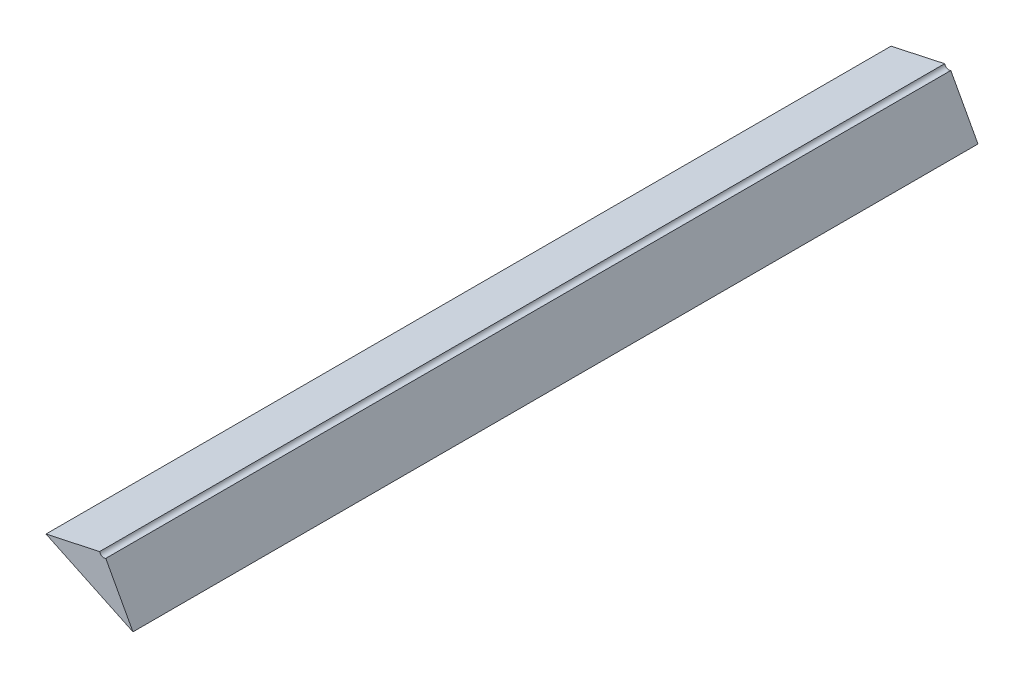
ISO-10303-21;
HEADER;
FILE_DESCRIPTION(('STEP AP214'),'2;1');
FILE_NAME('part.step','',(''),(''),'','','');
FILE_SCHEMA(('AUTOMOTIVE_DESIGN { 1 0 10303 214 1 1 1 1 }'));
ENDSEC;
DATA;
#1=APPLICATION_CONTEXT('core data for automotive mechanical design processes');
#2=APPLICATION_PROTOCOL_DEFINITION('international standard','automotive_design',2000,#1);
#3=PRODUCT_CONTEXT('',#1,'mechanical');
#4=PRODUCT('Part','Part','',(#3));
#5=PRODUCT_RELATED_PRODUCT_CATEGORY('part','',(#4));
#6=PRODUCT_DEFINITION_FORMATION('','',#4);
#7=PRODUCT_DEFINITION_CONTEXT('part definition',#1,'design');
#8=PRODUCT_DEFINITION('design','',#6,#7);
#9=PRODUCT_DEFINITION_SHAPE('','',#8);
#10=(LENGTH_UNIT() NAMED_UNIT(*) SI_UNIT(.MILLI.,.METRE.));
#11=(NAMED_UNIT(*) PLANE_ANGLE_UNIT() SI_UNIT($,.RADIAN.));
#12=(NAMED_UNIT(*) SI_UNIT($,.STERADIAN.) SOLID_ANGLE_UNIT());
#13=UNCERTAINTY_MEASURE_WITH_UNIT(LENGTH_MEASURE(1.E-05),#10,'distance_accuracy_value','');
#14=(GEOMETRIC_REPRESENTATION_CONTEXT(3) GLOBAL_UNCERTAINTY_ASSIGNED_CONTEXT((#13)) GLOBAL_UNIT_ASSIGNED_CONTEXT((#10,
#11,#12)) REPRESENTATION_CONTEXT('',''));
#15=CARTESIAN_POINT('',(0.,0.,0.));
#16=DIRECTION('',(0.,0.,1.));
#17=DIRECTION('',(1.,0.,0.));
#18=AXIS2_PLACEMENT_3D('',#15,#16,#17);
#19=CARTESIAN_POINT('',(-1.2868726607526,-0.398546889036204,0.1));
#20=DIRECTION('',(0.,0.,1.));
#21=DIRECTION('',(-1.,0.,0.));
#22=AXIS2_PLACEMENT_3D('',#19,#20,#21);
#23=CYLINDRICAL_SURFACE('',#22,0.0005);
#24=DIRECTION('',(0.,0.,1.));
#25=VECTOR('',#24,1.);
#26=CARTESIAN_POINT('',(-1.2866333665552,-0.398985908724936,0.1));
#27=LINE('',#26,#25);
#28=CARTESIAN_POINT('',(-1.2866333665552,-0.398985908724936,0.));
#29=VERTEX_POINT('',#28);
#30=CARTESIAN_POINT('',(-1.2866333665552,-0.398985908724936,0.1));
#31=VERTEX_POINT('',#30);
#32=EDGE_CURVE('E11',#29,#31,#27,.T.);
#33=ORIENTED_EDGE('',*,*,#32,.F.);
#34=CARTESIAN_POINT('',(-1.2868726607526,-0.398546889036204,0.));
#35=DIRECTION('',(0.,0.,1.));
#36=DIRECTION('',(-1.,0.,0.));
#37=AXIS2_PLACEMENT_3D('',#34,#35,#36);
#38=CIRCLE('',#37,0.0005);
#39=CARTESIAN_POINT('',(-1.2873614707226,-0.398652078452229,0.));
#40=VERTEX_POINT('',#39);
#41=EDGE_CURVE('E24',#40,#29,#38,.T.);
#42=ORIENTED_EDGE('',*,*,#41,.F.);
#43=DIRECTION('',(0.,0.,-1.));
#44=VECTOR('',#43,1.);
#45=CARTESIAN_POINT('',(-1.2873614707226,-0.398652078452229,0.1));
#46=LINE('',#45,#44);
#47=CARTESIAN_POINT('',(-1.2873614707226,-0.398652078452229,0.1));
#48=VERTEX_POINT('',#47);
#49=EDGE_CURVE('E78',#48,#40,#46,.T.);
#50=ORIENTED_EDGE('',*,*,#49,.F.);
#51=CARTESIAN_POINT('',(-1.2868726607526,-0.398546889036204,0.1));
#52=DIRECTION('',(0.,0.,-1.));
#53=DIRECTION('',(-1.,0.,0.));
#54=AXIS2_PLACEMENT_3D('',#51,#52,#53);
#55=CIRCLE('',#54,0.0005);
#56=EDGE_CURVE('E37',#31,#48,#55,.T.);
#57=ORIENTED_EDGE('',*,*,#56,.F.);
#58=EDGE_LOOP('',(#33,#42,#50,#57));
#59=FACE_BOUND('',#58,.T.);
#60=ADVANCED_FACE('F17',(#59),#23,.F.);
#61=CARTESIAN_POINT('',(-1.2881537061194,-0.4015821232958,0.1));
#62=DIRECTION('',(0.,0.,1.));
#63=DIRECTION('',(1.,0.,0.));
#64=AXIS2_PLACEMENT_3D('',#61,#62,#63);
#65=PLANE('',#64);
#66=DIRECTION('',(0.903806397975911,-0.427941578930827,0.));
#67=VECTOR('',#66,1.);
#68=CARTESIAN_POINT('',(-1.2941929476078,-0.40012217748513,0.1));
#69=LINE('',#68,#67);
#70=CARTESIAN_POINT('',(-1.2937051160019,-0.400025448708465,0.1));
#71=VERTEX_POINT('',#70);
#72=CARTESIAN_POINT('',(-1.2834134457547,-0.404908428179549,0.1));
#73=VERTEX_POINT('',#72);
#74=EDGE_CURVE('E63',#71,#73,#69,.T.);
#75=ORIENTED_EDGE('',*,*,#74,.T.);
#76=DIRECTION('',(-0.478588394782355,0.878039377465298,0.));
#77=VECTOR('',#76,1.);
#78=CARTESIAN_POINT('',(-1.2831689286298,-0.405341919343764,0.1));
#79=LINE('',#78,#77);
#80=EDGE_CURVE('E135',#73,#31,#79,.T.);
#81=ORIENTED_EDGE('',*,*,#80,.T.);
#82=ORIENTED_EDGE('',*,*,#56,.T.);
#83=DIRECTION('',(-0.977619939969144,-0.210378832050014,0.));
#84=VECTOR('',#83,1.);
#85=CARTESIAN_POINT('',(-1.2868726607526,-0.398546889036204,0.1));
#86=LINE('',#85,#84);
#87=EDGE_CURVE('E136',#48,#71,#86,.T.);
#88=ORIENTED_EDGE('',*,*,#87,.T.);
#89=EDGE_LOOP('',(#75,#81,#82,#88));
#90=FACE_BOUND('',#89,.T.);
#91=ADVANCED_FACE('F96',(#90),#65,.T.);
#92=CARTESIAN_POINT('',(-1.2941929476078,-0.40012217748513,0.));
#93=DIRECTION('',(-0.427941578930827,-0.903806397975911,0.));
#94=DIRECTION('',(0.903806397975911,-0.427941578930827,0.));
#95=AXIS2_PLACEMENT_3D('',#92,#93,#94);
#96=PLANE('',#95);
#97=CARTESIAN_POINT('',(-1.28340822282719,-0.404902899655032,0.1));
#98=DIRECTION('',(0.,0.,-1.));
#99=VECTOR('',#98,1.);
#100=LINE('',#97,#99);
#101=CARTESIAN_POINT('',(-1.2834134457547,-0.404908428179549,0.));
#102=VERTEX_POINT('',#101);
#103=EDGE_CURVE('E69',#73,#102,#100,.T.);
#104=ORIENTED_EDGE('',*,*,#103,.F.);
#105=ORIENTED_EDGE('',*,*,#74,.F.);
#106=CARTESIAN_POINT('',(-1.29370413763784,-0.400016988069105,0.));
#107=DIRECTION('',(0.,0.,1.));
#108=VECTOR('',#107,1.);
#109=LINE('',#106,#108);
#110=CARTESIAN_POINT('',(-1.2937051160019,-0.400025448708465,0.));
#111=VERTEX_POINT('',#110);
#112=EDGE_CURVE('E57',#111,#71,#109,.T.);
#113=ORIENTED_EDGE('',*,*,#112,.F.);
#114=DIRECTION('',(0.903806397975911,-0.427941578930827,0.));
#115=VECTOR('',#114,1.);
#116=CARTESIAN_POINT('',(-1.2941929476078,-0.40012217748513,0.));
#117=LINE('',#116,#115);
#118=EDGE_CURVE('E62',#111,#102,#117,.T.);
#119=ORIENTED_EDGE('',*,*,#118,.T.);
#120=EDGE_LOOP('',(#104,#105,#113,#119));
#121=FACE_BOUND('',#120,.T.);
#122=ADVANCED_FACE('F61',(#121),#96,.T.);
#123=CARTESIAN_POINT('',(-1.2868726607526,-0.398546889036204,0.));
#124=DIRECTION('',(-0.210378832050014,0.977619939969144,0.));
#125=DIRECTION('',(-0.977619939969144,-0.210378832050014,0.));
#126=AXIS2_PLACEMENT_3D('',#123,#124,#125);
#127=PLANE('',#126);
#128=ORIENTED_EDGE('',*,*,#49,.T.);
#129=DIRECTION('',(-0.977619939969144,-0.210378832050014,0.));
#130=VECTOR('',#129,1.);
#131=CARTESIAN_POINT('',(-1.2868726607526,-0.398546889036204,0.));
#132=LINE('',#131,#130);
#133=EDGE_CURVE('E73',#40,#111,#132,.T.);
#134=ORIENTED_EDGE('',*,*,#133,.T.);
#135=ORIENTED_EDGE('',*,*,#112,.T.);
#136=ORIENTED_EDGE('',*,*,#87,.F.);
#137=EDGE_LOOP('',(#128,#134,#135,#136));
#138=FACE_BOUND('',#137,.T.);
#139=ADVANCED_FACE('F77',(#138),#127,.T.);
#140=CARTESIAN_POINT('',(-1.2831689286298,-0.405341919343764,0.));
#141=DIRECTION('',(0.878039377465299,0.478588394782355,0.));
#142=DIRECTION('',(-0.478588394782355,0.878039377465299,0.));
#143=AXIS2_PLACEMENT_3D('',#140,#141,#142);
#144=PLANE('',#143);
#145=ORIENTED_EDGE('',*,*,#103,.T.);
#146=DIRECTION('',(-0.478588394782355,0.878039377465298,0.));
#147=VECTOR('',#146,1.);
#148=CARTESIAN_POINT('',(-1.2831689286298,-0.405341919343764,0.));
#149=LINE('',#148,#147);
#150=EDGE_CURVE('E75',#102,#29,#149,.T.);
#151=ORIENTED_EDGE('',*,*,#150,.T.);
#152=ORIENTED_EDGE('',*,*,#32,.T.);
#153=ORIENTED_EDGE('',*,*,#80,.F.);
#154=EDGE_LOOP('',(#145,#151,#152,#153));
#155=FACE_BOUND('',#154,.T.);
#156=ADVANCED_FACE('F114',(#155),#144,.T.);
#157=CARTESIAN_POINT('',(-1.2881537061194,-0.4015821232958,0.));
#158=DIRECTION('',(0.,0.,1.));
#159=DIRECTION('',(1.,0.,0.));
#160=AXIS2_PLACEMENT_3D('',#157,#158,#159);
#161=PLANE('',#160);
#162=ORIENTED_EDGE('',*,*,#133,.F.);
#163=ORIENTED_EDGE('',*,*,#41,.T.);
#164=ORIENTED_EDGE('',*,*,#150,.F.);
#165=ORIENTED_EDGE('',*,*,#118,.F.);
#166=EDGE_LOOP('',(#162,#163,#164,#165));
#167=FACE_BOUND('',#166,.T.);
#168=ADVANCED_FACE('F72',(#167),#161,.F.);
#169=CLOSED_SHELL('',(#60,#91,#122,#139,#156,#168));
#170=MANIFOLD_SOLID_BREP('B1',#169);
#171=ADVANCED_BREP_SHAPE_REPRESENTATION('',(#18,#170),#14);
#172=SHAPE_DEFINITION_REPRESENTATION(#9,#171);
ENDSEC;
END-ISO-10303-21;
